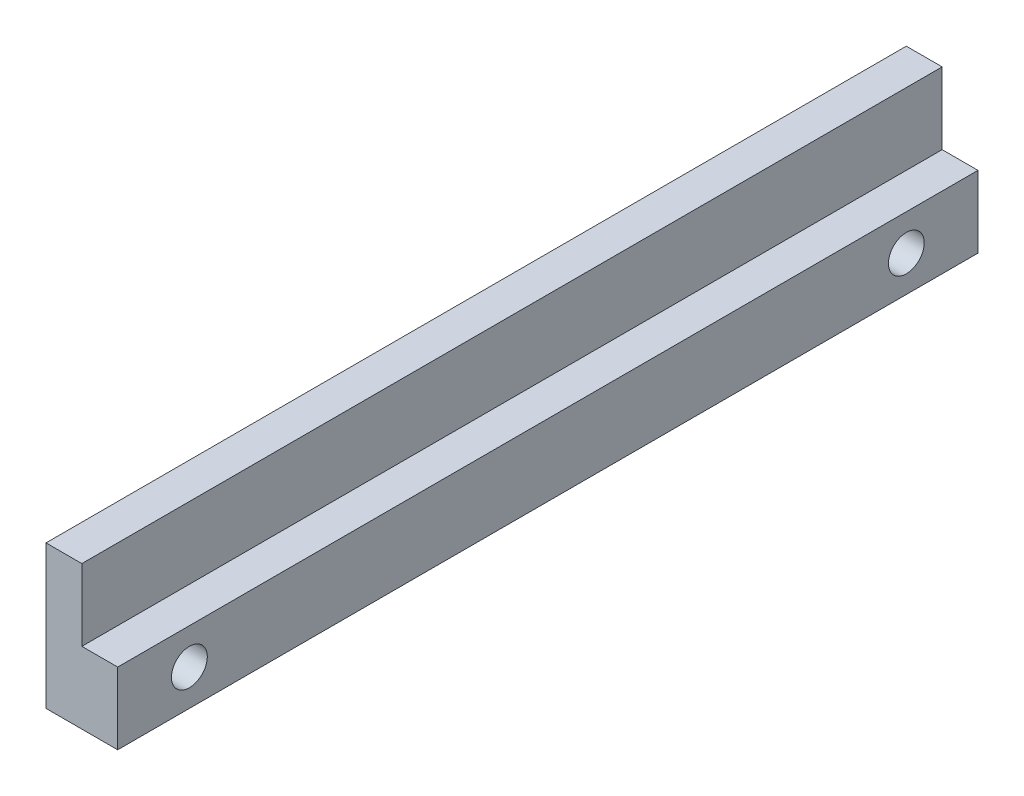
ISO-10303-21;
HEADER;
FILE_DESCRIPTION(('STEP AP214'),'2;1');
FILE_NAME('part.step','',(''),(''),'','','');
FILE_SCHEMA(('AUTOMOTIVE_DESIGN { 1 0 10303 214 1 1 1 1 }'));
ENDSEC;
DATA;
#1=APPLICATION_CONTEXT('core data for automotive mechanical design processes');
#2=APPLICATION_PROTOCOL_DEFINITION('international standard','automotive_design',2000,#1);
#3=PRODUCT_CONTEXT('',#1,'mechanical');
#4=PRODUCT('Part','Part','',(#3));
#5=PRODUCT_RELATED_PRODUCT_CATEGORY('part','',(#4));
#6=PRODUCT_DEFINITION_FORMATION('','',#4);
#7=PRODUCT_DEFINITION_CONTEXT('part definition',#1,'design');
#8=PRODUCT_DEFINITION('design','',#6,#7);
#9=PRODUCT_DEFINITION_SHAPE('','',#8);
#10=(LENGTH_UNIT() NAMED_UNIT(*) SI_UNIT(.MILLI.,.METRE.));
#11=(NAMED_UNIT(*) PLANE_ANGLE_UNIT() SI_UNIT($,.RADIAN.));
#12=(NAMED_UNIT(*) SI_UNIT($,.STERADIAN.) SOLID_ANGLE_UNIT());
#13=UNCERTAINTY_MEASURE_WITH_UNIT(LENGTH_MEASURE(1.E-05),#10,'distance_accuracy_value','');
#14=(GEOMETRIC_REPRESENTATION_CONTEXT(3) GLOBAL_UNCERTAINTY_ASSIGNED_CONTEXT((#13)) GLOBAL_UNIT_ASSIGNED_CONTEXT((#10,
#11,#12)) REPRESENTATION_CONTEXT('',''));
#15=CARTESIAN_POINT('',(0.,0.,0.));
#16=DIRECTION('',(0.,0.,1.));
#17=DIRECTION('',(1.,0.,0.));
#18=AXIS2_PLACEMENT_3D('',#15,#16,#17);
#19=CARTESIAN_POINT('',(-6.35,12.7,76.2));
#20=DIRECTION('',(0.,-1.,0.));
#21=DIRECTION('',(1.,0.,0.));
#22=AXIS2_PLACEMENT_3D('',#19,#20,#21);
#23=PLANE('',#22);
#24=DIRECTION('',(-1.,0.,0.));
#25=VECTOR('',#24,1.);
#26=CARTESIAN_POINT('',(-6.35,12.7,-76.2));
#27=LINE('',#26,#25);
#28=CARTESIAN_POINT('',(0.,12.7,-76.2));
#29=VERTEX_POINT('',#28);
#30=CARTESIAN_POINT('',(-6.35,12.7,-76.2));
#31=VERTEX_POINT('',#30);
#32=EDGE_CURVE('E118',#29,#31,#27,.T.);
#33=ORIENTED_EDGE('',*,*,#32,.T.);
#34=DIRECTION('',(0.,0.,-1.));
#35=VECTOR('',#34,1.);
#36=CARTESIAN_POINT('',(-6.35,12.7,76.2));
#37=LINE('',#36,#35);
#38=CARTESIAN_POINT('',(-6.35,12.7,76.2));
#39=VERTEX_POINT('',#38);
#40=EDGE_CURVE('E11',#39,#31,#37,.T.);
#41=ORIENTED_EDGE('',*,*,#40,.F.);
#42=DIRECTION('',(-1.,0.,0.));
#43=VECTOR('',#42,1.);
#44=CARTESIAN_POINT('',(-6.35,12.7,76.2));
#45=LINE('',#44,#43);
#46=CARTESIAN_POINT('',(0.,12.7,76.2));
#47=VERTEX_POINT('',#46);
#48=EDGE_CURVE('E129',#47,#39,#45,.T.);
#49=ORIENTED_EDGE('',*,*,#48,.F.);
#50=DIRECTION('',(0.,0.,-1.));
#51=VECTOR('',#50,1.);
#52=CARTESIAN_POINT('',(0.,12.7,76.2));
#53=LINE('',#52,#51);
#54=EDGE_CURVE('E114',#47,#29,#53,.T.);
#55=ORIENTED_EDGE('',*,*,#54,.T.);
#56=EDGE_LOOP('',(#33,#41,#49,#55));
#57=FACE_BOUND('',#56,.T.);
#58=ADVANCED_FACE('F34',(#57),#23,.F.);
#59=CARTESIAN_POINT('',(-6.35,-12.7,76.2));
#60=DIRECTION('',(1.,0.,0.));
#61=DIRECTION('',(0.,0.,-1.));
#62=AXIS2_PLACEMENT_3D('',#59,#60,#61);
#63=PLANE('',#62);
#64=CARTESIAN_POINT('',(-6.35,-6.34999999999998,63.5));
#65=DIRECTION('',(1.,0.,0.));
#66=DIRECTION('',(0.,0.,-1.));
#67=AXIS2_PLACEMENT_3D('',#64,#65,#66);
#68=CIRCLE('',#67,3.175);
#69=CARTESIAN_POINT('',(-6.35,-6.34999999999998,60.325));
#70=VERTEX_POINT('',#69);
#71=EDGE_CURVE('E122',#70,#70,#68,.T.);
#72=ORIENTED_EDGE('',*,*,#71,.T.);
#73=EDGE_LOOP('',(#72));
#74=FACE_BOUND('',#73,.T.);
#75=CARTESIAN_POINT('',(-6.35,-6.35,-63.5));
#76=DIRECTION('',(1.,0.,0.));
#77=DIRECTION('',(0.,0.,-1.));
#78=AXIS2_PLACEMENT_3D('',#75,#76,#77);
#79=CIRCLE('',#78,3.175);
#80=CARTESIAN_POINT('',(-6.35,-6.35,-66.675));
#81=VERTEX_POINT('',#80);
#82=EDGE_CURVE('E178',#81,#81,#79,.T.);
#83=ORIENTED_EDGE('',*,*,#82,.T.);
#84=EDGE_LOOP('',(#83));
#85=FACE_BOUND('',#84,.T.);
#86=DIRECTION('',(0.,-1.,0.));
#87=VECTOR('',#86,1.);
#88=CARTESIAN_POINT('',(-6.35,-12.7,-76.2));
#89=LINE('',#88,#87);
#90=CARTESIAN_POINT('',(-6.35,-12.7,-76.2));
#91=VERTEX_POINT('',#90);
#92=EDGE_CURVE('E121',#31,#91,#89,.T.);
#93=ORIENTED_EDGE('',*,*,#92,.T.);
#94=DIRECTION('',(0.,0.,-1.));
#95=VECTOR('',#94,1.);
#96=CARTESIAN_POINT('',(-6.35,-12.7,76.2));
#97=LINE('',#96,#95);
#98=CARTESIAN_POINT('',(-6.35,-12.7,76.2));
#99=VERTEX_POINT('',#98);
#100=EDGE_CURVE('E42',#99,#91,#97,.T.);
#101=ORIENTED_EDGE('',*,*,#100,.F.);
#102=DIRECTION('',(0.,-1.,0.));
#103=VECTOR('',#102,1.);
#104=CARTESIAN_POINT('',(-6.35,-12.7,76.2));
#105=LINE('',#104,#103);
#106=EDGE_CURVE('E87',#39,#99,#105,.T.);
#107=ORIENTED_EDGE('',*,*,#106,.F.);
#108=ORIENTED_EDGE('',*,*,#40,.T.);
#109=EDGE_LOOP('',(#93,#101,#107,#108));
#110=FACE_BOUND('',#109,.T.);
#111=ADVANCED_FACE('F153',(#74,#85,#110),#63,.F.);
#112=CARTESIAN_POINT('',(6.35,-12.7,76.2));
#113=DIRECTION('',(0.,1.,0.));
#114=DIRECTION('',(0.,0.,1.));
#115=AXIS2_PLACEMENT_3D('',#112,#113,#114);
#116=PLANE('',#115);
#117=DIRECTION('',(1.,0.,0.));
#118=VECTOR('',#117,1.);
#119=CARTESIAN_POINT('',(6.35,-12.7,-76.2));
#120=LINE('',#119,#118);
#121=CARTESIAN_POINT('',(6.35,-12.7,-76.2));
#122=VERTEX_POINT('',#121);
#123=EDGE_CURVE('E124',#91,#122,#120,.T.);
#124=ORIENTED_EDGE('',*,*,#123,.T.);
#125=DIRECTION('',(0.,0.,-1.));
#126=VECTOR('',#125,1.);
#127=CARTESIAN_POINT('',(6.35,-12.7,76.2));
#128=LINE('',#127,#126);
#129=CARTESIAN_POINT('',(6.35,-12.7,76.2));
#130=VERTEX_POINT('',#129);
#131=EDGE_CURVE('E109',#130,#122,#128,.T.);
#132=ORIENTED_EDGE('',*,*,#131,.F.);
#133=DIRECTION('',(1.,0.,0.));
#134=VECTOR('',#133,1.);
#135=CARTESIAN_POINT('',(6.35,-12.7,76.2));
#136=LINE('',#135,#134);
#137=EDGE_CURVE('E100',#99,#130,#136,.T.);
#138=ORIENTED_EDGE('',*,*,#137,.F.);
#139=ORIENTED_EDGE('',*,*,#100,.T.);
#140=EDGE_LOOP('',(#124,#132,#138,#139));
#141=FACE_BOUND('',#140,.T.);
#142=ADVANCED_FACE('F135',(#141),#116,.F.);
#143=CARTESIAN_POINT('',(6.35,0.,76.2));
#144=DIRECTION('',(-1.,0.,0.));
#145=DIRECTION('',(0.,-1.,0.));
#146=AXIS2_PLACEMENT_3D('',#143,#144,#145);
#147=PLANE('',#146);
#148=CARTESIAN_POINT('',(6.35,-6.34999999999998,63.5));
#149=DIRECTION('',(-1.,0.,0.));
#150=DIRECTION('',(0.,0.,-1.));
#151=AXIS2_PLACEMENT_3D('',#148,#149,#150);
#152=CIRCLE('',#151,3.175);
#153=CARTESIAN_POINT('',(6.35,-6.34999999999998,60.325));
#154=VERTEX_POINT('',#153);
#155=EDGE_CURVE('E172',#154,#154,#152,.T.);
#156=ORIENTED_EDGE('',*,*,#155,.T.);
#157=EDGE_LOOP('',(#156));
#158=FACE_BOUND('',#157,.T.);
#159=CARTESIAN_POINT('',(6.35,-6.35,-63.5));
#160=DIRECTION('',(-1.,0.,0.));
#161=DIRECTION('',(0.,0.,1.));
#162=AXIS2_PLACEMENT_3D('',#159,#160,#161);
#163=CIRCLE('',#162,3.175);
#164=CARTESIAN_POINT('',(6.35,-6.35,-60.325));
#165=VERTEX_POINT('',#164);
#166=EDGE_CURVE('E175',#165,#165,#163,.T.);
#167=ORIENTED_EDGE('',*,*,#166,.T.);
#168=EDGE_LOOP('',(#167));
#169=FACE_BOUND('',#168,.T.);
#170=DIRECTION('',(0.,1.,0.));
#171=VECTOR('',#170,1.);
#172=CARTESIAN_POINT('',(6.35,0.,-76.2));
#173=LINE('',#172,#171);
#174=CARTESIAN_POINT('',(6.35,0.,-76.2));
#175=VERTEX_POINT('',#174);
#176=EDGE_CURVE('E108',#122,#175,#173,.T.);
#177=ORIENTED_EDGE('',*,*,#176,.T.);
#178=DIRECTION('',(0.,0.,-1.));
#179=VECTOR('',#178,1.);
#180=CARTESIAN_POINT('',(6.35,0.,76.2));
#181=LINE('',#180,#179);
#182=CARTESIAN_POINT('',(6.35,0.,76.2));
#183=VERTEX_POINT('',#182);
#184=EDGE_CURVE('E105',#183,#175,#181,.T.);
#185=ORIENTED_EDGE('',*,*,#184,.F.);
#186=DIRECTION('',(0.,1.,0.));
#187=VECTOR('',#186,1.);
#188=CARTESIAN_POINT('',(6.35,0.,76.2));
#189=LINE('',#188,#187);
#190=EDGE_CURVE('E94',#130,#183,#189,.T.);
#191=ORIENTED_EDGE('',*,*,#190,.F.);
#192=ORIENTED_EDGE('',*,*,#131,.T.);
#193=EDGE_LOOP('',(#177,#185,#191,#192));
#194=FACE_BOUND('',#193,.T.);
#195=ADVANCED_FACE('F106',(#158,#169,#194),#147,.F.);
#196=CARTESIAN_POINT('',(0.,0.,76.2));
#197=DIRECTION('',(0.,-1.,0.));
#198=DIRECTION('',(0.,0.,-1.));
#199=AXIS2_PLACEMENT_3D('',#196,#197,#198);
#200=PLANE('',#199);
#201=DIRECTION('',(-1.,0.,0.));
#202=VECTOR('',#201,1.);
#203=CARTESIAN_POINT('',(0.,0.,-76.2));
#204=LINE('',#203,#202);
#205=CARTESIAN_POINT('',(0.,0.,-76.2));
#206=VERTEX_POINT('',#205);
#207=EDGE_CURVE('E73',#175,#206,#204,.T.);
#208=ORIENTED_EDGE('',*,*,#207,.T.);
#209=DIRECTION('',(0.,0.,-1.));
#210=VECTOR('',#209,1.);
#211=CARTESIAN_POINT('',(0.,0.,76.2));
#212=LINE('',#211,#210);
#213=CARTESIAN_POINT('',(0.,0.,76.2));
#214=VERTEX_POINT('',#213);
#215=EDGE_CURVE('E110',#214,#206,#212,.T.);
#216=ORIENTED_EDGE('',*,*,#215,.F.);
#217=DIRECTION('',(-1.,0.,0.));
#218=VECTOR('',#217,1.);
#219=CARTESIAN_POINT('',(0.,0.,76.2));
#220=LINE('',#219,#218);
#221=EDGE_CURVE('E98',#183,#214,#220,.T.);
#222=ORIENTED_EDGE('',*,*,#221,.F.);
#223=ORIENTED_EDGE('',*,*,#184,.T.);
#224=EDGE_LOOP('',(#208,#216,#222,#223));
#225=FACE_BOUND('',#224,.T.);
#226=ADVANCED_FACE('F112',(#225),#200,.F.);
#227=CARTESIAN_POINT('',(0.,12.7,76.2));
#228=DIRECTION('',(-1.,0.,0.));
#229=DIRECTION('',(0.,0.,1.));
#230=AXIS2_PLACEMENT_3D('',#227,#228,#229);
#231=PLANE('',#230);
#232=DIRECTION('',(0.,1.,0.));
#233=VECTOR('',#232,1.);
#234=CARTESIAN_POINT('',(0.,12.7,-76.2));
#235=LINE('',#234,#233);
#236=EDGE_CURVE('E79',#206,#29,#235,.T.);
#237=ORIENTED_EDGE('',*,*,#236,.T.);
#238=ORIENTED_EDGE('',*,*,#54,.F.);
#239=DIRECTION('',(0.,1.,0.));
#240=VECTOR('',#239,1.);
#241=CARTESIAN_POINT('',(0.,12.7,76.2));
#242=LINE('',#241,#240);
#243=EDGE_CURVE('E50',#214,#47,#242,.T.);
#244=ORIENTED_EDGE('',*,*,#243,.F.);
#245=ORIENTED_EDGE('',*,*,#215,.T.);
#246=EDGE_LOOP('',(#237,#238,#244,#245));
#247=FACE_BOUND('',#246,.T.);
#248=ADVANCED_FACE('F142',(#247),#231,.F.);
#249=CARTESIAN_POINT('',(0.,0.,76.2));
#250=DIRECTION('',(0.,0.,-1.));
#251=DIRECTION('',(-1.,0.,0.));
#252=AXIS2_PLACEMENT_3D('',#249,#250,#251);
#253=PLANE('',#252);
#254=ORIENTED_EDGE('',*,*,#48,.T.);
#255=ORIENTED_EDGE('',*,*,#106,.T.);
#256=ORIENTED_EDGE('',*,*,#137,.T.);
#257=ORIENTED_EDGE('',*,*,#190,.T.);
#258=ORIENTED_EDGE('',*,*,#221,.T.);
#259=ORIENTED_EDGE('',*,*,#243,.T.);
#260=EDGE_LOOP('',(#254,#255,#256,#257,#258,#259));
#261=FACE_BOUND('',#260,.T.);
#262=ADVANCED_FACE('F96',(#261),#253,.F.);
#263=CARTESIAN_POINT('',(0.,0.,-76.2));
#264=DIRECTION('',(0.,0.,-1.));
#265=DIRECTION('',(-1.,0.,0.));
#266=AXIS2_PLACEMENT_3D('',#263,#264,#265);
#267=PLANE('',#266);
#268=ORIENTED_EDGE('',*,*,#32,.F.);
#269=ORIENTED_EDGE('',*,*,#236,.F.);
#270=ORIENTED_EDGE('',*,*,#207,.F.);
#271=ORIENTED_EDGE('',*,*,#176,.F.);
#272=ORIENTED_EDGE('',*,*,#123,.F.);
#273=ORIENTED_EDGE('',*,*,#92,.F.);
#274=EDGE_LOOP('',(#268,#269,#270,#271,#272,#273));
#275=FACE_BOUND('',#274,.T.);
#276=ADVANCED_FACE('F138',(#275),#267,.T.);
#277=CARTESIAN_POINT('',(6.35,-6.35,-63.5));
#278=DIRECTION('',(-1.,0.,0.));
#279=DIRECTION('',(0.,0.,1.));
#280=AXIS2_PLACEMENT_3D('',#277,#278,#279);
#281=CYLINDRICAL_SURFACE('',#280,3.175);
#282=ORIENTED_EDGE('',*,*,#166,.F.);
#283=EDGE_LOOP('',(#282));
#284=FACE_BOUND('',#283,.T.);
#285=ORIENTED_EDGE('',*,*,#82,.F.);
#286=EDGE_LOOP('',(#285));
#287=FACE_BOUND('',#286,.T.);
#288=ADVANCED_FACE('F189',(#284,#287),#281,.F.);
#289=CARTESIAN_POINT('',(6.35,-6.34999999999998,63.5));
#290=DIRECTION('',(-1.,0.,0.));
#291=DIRECTION('',(0.,0.,1.));
#292=AXIS2_PLACEMENT_3D('',#289,#290,#291);
#293=CYLINDRICAL_SURFACE('',#292,3.175);
#294=ORIENTED_EDGE('',*,*,#155,.F.);
#295=EDGE_LOOP('',(#294));
#296=FACE_BOUND('',#295,.T.);
#297=ORIENTED_EDGE('',*,*,#71,.F.);
#298=EDGE_LOOP('',(#297));
#299=FACE_BOUND('',#298,.T.);
#300=ADVANCED_FACE('F187',(#296,#299),#293,.F.);
#301=CLOSED_SHELL('',(#58,#111,#142,#195,#226,#248,#262,#276,#288,#300));
#302=MANIFOLD_SOLID_BREP('B2',#301);
#303=ADVANCED_BREP_SHAPE_REPRESENTATION('',(#18,#302),#14);
#304=SHAPE_DEFINITION_REPRESENTATION(#9,#303);
ENDSEC;
END-ISO-10303-21;
